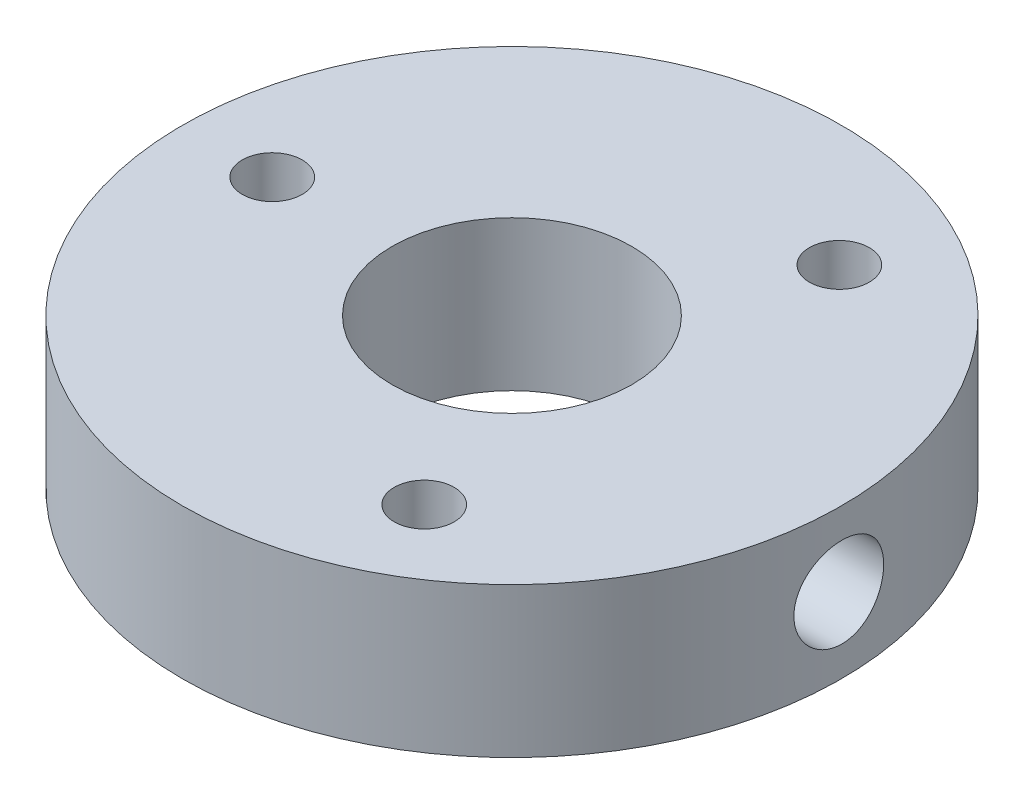
ISO-10303-21;
HEADER;
FILE_DESCRIPTION(('STEP AP214'),'2;1');
FILE_NAME('part.step','',(''),(''),'','','');
FILE_SCHEMA(('AUTOMOTIVE_DESIGN { 1 0 10303 214 1 1 1 1 }'));
ENDSEC;
DATA;
#1=APPLICATION_CONTEXT('core data for automotive mechanical design processes');
#2=APPLICATION_PROTOCOL_DEFINITION('international standard','automotive_design',2000,#1);
#3=PRODUCT_CONTEXT('',#1,'mechanical');
#4=PRODUCT('Part','Part','',(#3));
#5=PRODUCT_RELATED_PRODUCT_CATEGORY('part','',(#4));
#6=PRODUCT_DEFINITION_FORMATION('','',#4);
#7=PRODUCT_DEFINITION_CONTEXT('part definition',#1,'design');
#8=PRODUCT_DEFINITION('design','',#6,#7);
#9=PRODUCT_DEFINITION_SHAPE('','',#8);
#10=(LENGTH_UNIT() NAMED_UNIT(*) SI_UNIT(.MILLI.,.METRE.));
#11=(NAMED_UNIT(*) PLANE_ANGLE_UNIT() SI_UNIT($,.RADIAN.));
#12=(NAMED_UNIT(*) SI_UNIT($,.STERADIAN.) SOLID_ANGLE_UNIT());
#13=UNCERTAINTY_MEASURE_WITH_UNIT(LENGTH_MEASURE(1.E-05),#10,'distance_accuracy_value','');
#14=(GEOMETRIC_REPRESENTATION_CONTEXT(3) GLOBAL_UNCERTAINTY_ASSIGNED_CONTEXT((#13)) GLOBAL_UNIT_ASSIGNED_CONTEXT((#10,
#11,#12)) REPRESENTATION_CONTEXT('',''));
#15=CARTESIAN_POINT('',(0.,0.,0.));
#16=DIRECTION('',(0.,0.,1.));
#17=DIRECTION('',(1.,0.,0.));
#18=AXIS2_PLACEMENT_3D('',#15,#16,#17);
#19=CARTESIAN_POINT('',(0.,5.,0.));
#20=DIRECTION('',(0.,-1.,0.));
#21=DIRECTION('',(0.,0.,-1.));
#22=AXIS2_PLACEMENT_3D('',#19,#20,#21);
#23=CYLINDRICAL_SURFACE('',#22,11.);
#24=CARTESIAN_POINT('',(0.,5.,0.));
#25=DIRECTION('',(0.,1.,0.));
#26=DIRECTION('',(0.,0.,1.));
#27=AXIS2_PLACEMENT_3D('',#24,#25,#26);
#28=CIRCLE('',#27,11.);
#29=CARTESIAN_POINT('',(0.,5.,11.));
#30=VERTEX_POINT('',#29);
#31=EDGE_CURVE('E10',#30,#30,#28,.T.);
#32=ORIENTED_EDGE('',*,*,#31,.F.);
#33=EDGE_LOOP('',(#32));
#34=FACE_BOUND('',#33,.T.);
#35=CARTESIAN_POINT('',(0.,0.,0.));
#36=DIRECTION('',(0.,1.,0.));
#37=DIRECTION('',(0.,0.,1.));
#38=AXIS2_PLACEMENT_3D('',#35,#36,#37);
#39=CIRCLE('',#38,11.);
#40=CARTESIAN_POINT('',(0.,0.,11.));
#41=VERTEX_POINT('',#40);
#42=EDGE_CURVE('E42',#41,#41,#39,.T.);
#43=ORIENTED_EDGE('',*,*,#42,.T.);
#44=EDGE_LOOP('',(#43));
#45=FACE_BOUND('',#44,.T.);
#46=CARTESIAN_POINT('',(10.9999939067479,0.999973189554509,-0.0115780615405815));
#47=CARTESIAN_POINT('',(10.9999044002956,0.999976711132381,-0.0954239428171522));
#48=CARTESIAN_POINT('',(10.9988486008571,1.00702704512846,-0.179319631083675));
#49=CARTESIAN_POINT('',(10.9949080187248,1.03503735855822,-0.344769861813248));
#50=CARTESIAN_POINT('',(10.9920213790592,1.05601146150291,-0.426321939325376));
#51=CARTESIAN_POINT('',(10.98473686535,1.11123516899209,-0.584666224667857));
#52=CARTESIAN_POINT('',(10.9803400691835,1.14547530710418,-0.661461781454382));
#53=CARTESIAN_POINT('',(10.9705160795339,1.22623726751858,-0.808202920455653));
#54=CARTESIAN_POINT('',(10.9650890483315,1.2727571559883,-0.878149578868961));
#55=CARTESIAN_POINT('',(10.9537635745378,1.37708417850228,-1.00967984400745));
#56=CARTESIAN_POINT('',(10.9478625538162,1.43495591158858,-1.07121199577974));
#57=CARTESIAN_POINT('',(10.9362702751757,1.56020505433128,-1.18372266629456));
#58=CARTESIAN_POINT('',(10.9305790285062,1.62758297283648,-1.2347006197294));
#59=CARTESIAN_POINT('',(10.9200209026938,1.77026492357159,-1.32484675059802));
#60=CARTESIAN_POINT('',(10.9151573978268,1.84559946113343,-1.36396707348648));
#61=CARTESIAN_POINT('',(10.906837084338,2.0018476138882,-1.42898062192559));
#62=CARTESIAN_POINT('',(10.9033802111253,2.08276097270822,-1.45487445483607));
#63=CARTESIAN_POINT('',(10.8982882263128,2.24732559542325,-1.49254022772958));
#64=CARTESIAN_POINT('',(10.8966416950812,2.33095623040053,-1.50440072652711));
#65=CARTESIAN_POINT('',(10.8953209215694,2.49903579140636,-1.51393744719754));
#66=CARTESIAN_POINT('',(10.8956465841323,2.58348467775863,-1.51161435341767));
#67=CARTESIAN_POINT('',(10.8982232528905,2.75018819297928,-1.49292181211566));
#68=CARTESIAN_POINT('',(10.9004609427832,2.83245395009811,-1.47664951122397));
#69=CARTESIAN_POINT('',(10.9065902097652,2.99307607448458,-1.43067228746452));
#70=CARTESIAN_POINT('',(10.9104818264021,3.07143234822133,-1.4009670433966));
#71=CARTESIAN_POINT('',(10.919498027195,3.22231035776718,-1.32886437295365));
#72=CARTESIAN_POINT('',(10.9246266553675,3.29481189366574,-1.28642520365774));
#73=CARTESIAN_POINT('',(10.9355397462768,3.43170097824377,-1.19008946354791));
#74=CARTESIAN_POINT('',(10.9413242451384,3.49608807957349,-1.13619226149098));
#75=CARTESIAN_POINT('',(10.9529614111083,3.61548585862308,-1.01793301552608));
#76=CARTESIAN_POINT('',(10.958814243346,3.6704134739691,-0.953487091871597));
#77=CARTESIAN_POINT('',(10.9698893132462,3.76868518525505,-0.816247444682634));
#78=CARTESIAN_POINT('',(10.9751115484899,3.81202923676403,-0.743453689129999));
#79=CARTESIAN_POINT('',(10.9843481970648,3.88590922505678,-0.591509860023813));
#80=CARTESIAN_POINT('',(10.988361959237,3.91643826023238,-0.512356388672724));
#81=CARTESIAN_POINT('',(10.9947310344779,3.96374735450702,-0.349979063061778));
#82=CARTESIAN_POINT('',(10.9970864401793,3.98052818156342,-0.266755436430828));
#83=CARTESIAN_POINT('',(10.9998678371537,3.99975618390085,-0.0993087436609927));
#84=CARTESIAN_POINT('',(11.0003090228686,4.00231628431788,-0.0150988884889781));
#85=CARTESIAN_POINT('',(10.9992615884094,3.99332787428998,0.152550405083048));
#86=CARTESIAN_POINT('',(10.997773018736,3.98177973305065,0.235989863586379));
#87=CARTESIAN_POINT('',(10.993050105093,3.94499769004844,0.399382791138893));
#88=CARTESIAN_POINT('',(10.9898228878614,3.91981965537183,0.479349060854837));
#89=CARTESIAN_POINT('',(10.9819913273209,3.85654986445647,0.633925431514962));
#90=CARTESIAN_POINT('',(10.9773869302623,3.81845760418203,0.708535323264673));
#91=CARTESIAN_POINT('',(10.9672835328389,3.73017677096168,0.850771743827461));
#92=CARTESIAN_POINT('',(10.9617793511928,3.67991727682904,0.918353879614561));
#93=CARTESIAN_POINT('',(10.9505122316388,3.56882824318384,1.04416429686349));
#94=CARTESIAN_POINT('',(10.9447492814637,3.50799820217008,1.10239213427457));
#95=CARTESIAN_POINT('',(10.9335723115317,3.37699692939782,1.20824511832104));
#96=CARTESIAN_POINT('',(10.9281609394703,3.30676482123387,1.25579524784778));
#97=CARTESIAN_POINT('',(10.9183496786287,3.15924630749901,1.33842406066923));
#98=CARTESIAN_POINT('',(10.9139497671196,3.08196006049805,1.37350302421648));
#99=CARTESIAN_POINT('',(10.9066810546339,2.92275155286305,1.43007870532568));
#100=CARTESIAN_POINT('',(10.9038078069136,2.84084353370812,1.45161490316806));
#101=CARTESIAN_POINT('',(10.8999075128719,2.67453195419288,1.48061944438329));
#102=CARTESIAN_POINT('',(10.8988803644016,2.59012853217156,1.48808856612045));
#103=CARTESIAN_POINT('',(10.8987925921157,2.42195769079882,1.48873082572869));
#104=CARTESIAN_POINT('',(10.8997159948193,2.33819069982979,1.48202008538354));
#105=CARTESIAN_POINT('',(10.9033901730143,2.17298745367087,1.45474028049868));
#106=CARTESIAN_POINT('',(10.9061409476919,2.09155119744316,1.43417122212992));
#107=CARTESIAN_POINT('',(10.9131528707428,1.93334372943179,1.37979702053601));
#108=CARTESIAN_POINT('',(10.9174132542159,1.85657017814785,1.3459985795688));
#109=CARTESIAN_POINT('',(10.9269624876852,1.70976485000615,1.26613626694733));
#110=CARTESIAN_POINT('',(10.9322513595754,1.63973321671467,1.22007213417905));
#111=CARTESIAN_POINT('',(10.9433093878957,1.50780727073071,1.11655835227586));
#112=CARTESIAN_POINT('',(10.9490819836509,1.44598103541271,1.05902229948107));
#113=CARTESIAN_POINT('',(10.9604216604669,1.33281815760049,0.93437933205363));
#114=CARTESIAN_POINT('',(10.9659886932467,1.28148396671787,0.86727018674099));
#115=CARTESIAN_POINT('',(10.9763115058519,1.19056638907604,0.725043235411399));
#116=CARTESIAN_POINT('',(10.9810636131872,1.15103563158698,0.64989153192116));
#117=CARTESIAN_POINT('',(10.9891783998858,1.08521356199496,0.493990429589754));
#118=CARTESIAN_POINT('',(10.9925425585829,1.05890814719382,0.413247098335224));
#119=CARTESIAN_POINT('',(10.9967100519543,1.02644160832003,0.274827372205197));
#120=CARTESIAN_POINT('',(10.9979880488283,1.01653051392408,0.218015992941725));
#121=CARTESIAN_POINT('',(10.9996607217132,1.00329512551116,0.103618221672079));
#122=CARTESIAN_POINT('',(11.0000554059838,0.99997076990383,0.0460318369177843));
#123=CARTESIAN_POINT('',(10.9999939067479,0.999973189554509,-0.0115780615405815));
#124=B_SPLINE_CURVE_WITH_KNOTS('',3,(#46,#47,#48,#49,#50,#51,#52,#53,#54,#55,#56,#57,#58,#59,
#60,#61,#62,#63,#64,#65,#66,#67,#68,#69,#70,#71,#72,#73,#74,#75,#76,#77,#78,#79,#80,#81,#82,#83,
#84,#85,#86,#87,#88,#89,#90,#91,#92,#93,#94,#95,#96,#97,#98,#99,#100,#101,#102,#103,#104,#105,
#106,#107,#108,#109,#110,#111,#112,#113,#114,#115,#116,#117,#118,#119,#120,#121,#122,#123),
.UNSPECIFIED.,.T.,.F.,(4,2,2,2,2,2,2,2,2,2,2,2,2,2,2,2,2,2,2,2,2,2,2,2,2,2,2,2,2,2,2,2,2,2,2,2,
2,2,4),(0.,0.251327289981508,0.502909902968483,0.754313320259995,1.00567716977855,
1.25851525770487,1.51136688473197,1.76522577458424,2.01907300619958,2.27130961643428,
2.52353405654616,2.77401606645188,3.02450406604402,3.27582232859366,3.52715444029413,
3.78059190735547,4.03403034650999,4.28760510196434,4.54116569209054,4.79270987717716,
5.04424747961974,5.29476178499023,5.5452858689331,5.79730695556836,6.04934000217154,
6.30309187967885,6.55683805450331,6.80984102905535,7.06283000394816,7.31375523329677,
7.56468035091142,7.81547850926379,8.0662820070748,8.31905115917787,8.57187930694296,
8.82581848758399,9.07948630558812,9.25217308309859,9.42485824586635),.UNSPECIFIED.);
#125=CARTESIAN_POINT('',(10.9999939067479,0.999973189554509,-0.0115780615405815));
#126=VERTEX_POINT('',#125);
#127=EDGE_CURVE('E70',#126,#126,#124,.T.);
#128=ORIENTED_EDGE('',*,*,#127,.F.);
#129=EDGE_LOOP('',(#128));
#130=FACE_BOUND('',#129,.T.);
#131=ADVANCED_FACE('F30',(#34,#45,#130),#23,.T.);
#132=CARTESIAN_POINT('',(0.,5.,0.));
#133=DIRECTION('',(0.,-1.,0.));
#134=DIRECTION('',(0.,0.,-1.));
#135=AXIS2_PLACEMENT_3D('',#132,#133,#134);
#136=CYLINDRICAL_SURFACE('',#135,4.);
#137=CARTESIAN_POINT('',(0.,0.,0.));
#138=DIRECTION('',(0.,1.,0.));
#139=DIRECTION('',(0.,0.,1.));
#140=AXIS2_PLACEMENT_3D('',#137,#138,#139);
#141=CIRCLE('',#140,4.);
#142=CARTESIAN_POINT('',(0.,0.,4.));
#143=VERTEX_POINT('',#142);
#144=EDGE_CURVE('E49',#143,#143,#141,.T.);
#145=ORIENTED_EDGE('',*,*,#144,.F.);
#146=EDGE_LOOP('',(#145));
#147=FACE_BOUND('',#146,.T.);
#148=CARTESIAN_POINT('',(0.,5.,0.));
#149=DIRECTION('',(0.,1.,0.));
#150=DIRECTION('',(0.,0.,1.));
#151=AXIS2_PLACEMENT_3D('',#148,#149,#150);
#152=CIRCLE('',#151,4.);
#153=CARTESIAN_POINT('',(0.,5.,4.));
#154=VERTEX_POINT('',#153);
#155=EDGE_CURVE('E47',#154,#154,#152,.T.);
#156=ORIENTED_EDGE('',*,*,#155,.T.);
#157=EDGE_LOOP('',(#156));
#158=FACE_BOUND('',#157,.T.);
#159=CARTESIAN_POINT('',(3.99998324352627,0.999973189554461,-0.0115780615405819));
#160=CARTESIAN_POINT('',(3.99975008554708,0.999970344589806,-0.0928628499127886));
#161=CARTESIAN_POINT('',(3.99701341518181,1.00660111653291,-0.174120798016054));
#162=CARTESIAN_POINT('',(3.98682130674948,1.03283486326652,-0.334193212942549));
#163=CARTESIAN_POINT('',(3.97936650598513,1.05243608608623,-0.413008008267291));
#164=CARTESIAN_POINT('',(3.96052082036351,1.10381405386754,-0.565863400872514));
#165=CARTESIAN_POINT('',(3.94913764614027,1.13556696063538,-0.639913015944727));
#166=CARTESIAN_POINT('',(3.92355146951754,1.21022564505436,-0.781623509330774));
#167=CARTESIAN_POINT('',(3.90934771247029,1.25313440841045,-0.849282670712558));
#168=CARTESIAN_POINT('',(3.87889078281248,1.35081392052441,-0.979199713670536));
#169=CARTESIAN_POINT('',(3.86257952514767,1.40597987330045,-1.04114672329833));
#170=CARTESIAN_POINT('',(3.83003121413836,1.52576936090546,-1.15515471741959));
#171=CARTESIAN_POINT('',(3.81379418521259,1.59039580527675,-1.2072126492027));
#172=CARTESIAN_POINT('',(3.78254273246675,1.73026294512599,-1.30190458734573));
#173=CARTESIAN_POINT('',(3.76759791738499,1.80581297173165,-1.3441069284853));
#174=CARTESIAN_POINT('',(3.74152823394741,1.96359581643656,-1.41506404169484));
#175=CARTESIAN_POINT('',(3.73040179592602,2.04582587126365,-1.44382434130825));
#176=CARTESIAN_POINT('',(3.71386253492558,2.211000319316,-1.48583929908874));
#177=CARTESIAN_POINT('',(3.7082287534549,2.29376867612318,-1.49969614198542));
#178=CARTESIAN_POINT('',(3.70266090021209,2.46063289403003,-1.51339438709441));
#179=CARTESIAN_POINT('',(3.70272444475709,2.54472818523452,-1.51324165072145));
#180=CARTESIAN_POINT('',(3.70835486903642,2.70642618018637,-1.4993825756083));
#181=CARTESIAN_POINT('',(3.71358756798555,2.78411320704535,-1.48649924275674));
#182=CARTESIAN_POINT('',(3.72841590316254,2.93612790331047,-1.44890266336808));
#183=CARTESIAN_POINT('',(3.73801220421891,3.0104550589164,-1.42418761414722));
#184=CARTESIAN_POINT('',(3.7606954708555,3.15532654656717,-1.3631737441909));
#185=CARTESIAN_POINT('',(3.77384625274862,3.22577013919292,-1.32666049118578));
#186=CARTESIAN_POINT('',(3.80214335816573,3.35976767038173,-1.24323861437436));
#187=CARTESIAN_POINT('',(3.81729037578849,3.42331919847259,-1.19632637091242));
#188=CARTESIAN_POINT('',(3.84914555944359,3.54629447522197,-1.08966853799965));
#189=CARTESIAN_POINT('',(3.86588969675817,3.60513993697385,-1.02926532229988));
#190=CARTESIAN_POINT('',(3.89818043796217,3.71203825019438,-0.899261302268098));
#191=CARTESIAN_POINT('',(3.91372684917553,3.76008936756814,-0.829659022969195));
#192=CARTESIAN_POINT('',(3.94221113310178,3.8447026635441,-0.681711093905407));
#193=CARTESIAN_POINT('',(3.95510235757426,3.8810648118745,-0.603241422872247));
#194=CARTESIAN_POINT('',(3.97649279579293,3.93987649720795,-0.440692644837723));
#195=CARTESIAN_POINT('',(3.98499396386388,3.96233222583093,-0.356616052728382));
#196=CARTESIAN_POINT('',(3.99630791917595,3.9915879889453,-0.190047286850731));
#197=CARTESIAN_POINT('',(3.99939954802317,3.99915812800678,-0.107709210295274));
#198=CARTESIAN_POINT('',(4.00044046134103,4.00066276920371,0.0571144776457788));
#199=CARTESIAN_POINT('',(3.99839091439389,3.99460037002883,0.13960005124675));
#200=CARTESIAN_POINT('',(3.98957835374415,3.96960065090721,0.298984506989955));
#201=CARTESIAN_POINT('',(3.9830033920028,3.95117771238025,0.375975612427952));
#202=CARTESIAN_POINT('',(3.96601746346786,3.90264961804183,0.525726911204085));
#203=CARTESIAN_POINT('',(3.9556060098418,3.87254297959897,0.598486566234137));
#204=CARTESIAN_POINT('',(3.93162049822347,3.80056935441741,0.740043350915932));
#205=CARTESIAN_POINT('',(3.91796453813558,3.75839077379971,0.808667739861773));
#206=CARTESIAN_POINT('',(3.88900736327882,3.66382260696433,0.938097766999711));
#207=CARTESIAN_POINT('',(3.87370554817124,3.61142928913878,0.998900534313277));
#208=CARTESIAN_POINT('',(3.84205718511951,3.49436262149545,1.11463136577909));
#209=CARTESIAN_POINT('',(3.82570130693831,3.4291550887557,1.16901791033276));
#210=CARTESIAN_POINT('',(3.79465134791515,3.29022682093134,1.26618750552289));
#211=CARTESIAN_POINT('',(3.77995741951836,3.21650530613879,1.30896949221407));
#212=CARTESIAN_POINT('',(3.7539555435991,3.06199239818725,1.38178422652516));
#213=CARTESIAN_POINT('',(3.74266381223775,2.98116944589477,1.41175619177559));
#214=CARTESIAN_POINT('',(3.72510206372358,2.81508753633808,1.45747241666091));
#215=CARTESIAN_POINT('',(3.71882900164919,2.7298313023242,1.47322530402451));
#216=CARTESIAN_POINT('',(3.71242566949362,2.56309653328512,1.48928285927295));
#217=CARTESIAN_POINT('',(3.71193279140504,2.48171904954597,1.4904995243622));
#218=CARTESIAN_POINT('',(3.71621621167578,2.31998312988443,1.47978705914164));
#219=CARTESIAN_POINT('',(3.72099201372942,2.23962459869867,1.4678591670393));
#220=CARTESIAN_POINT('',(3.73496817769586,2.08466204182012,1.43190952995105));
#221=CARTESIAN_POINT('',(3.74403107088274,2.00995761843741,1.40826251490059));
#222=CARTESIAN_POINT('',(3.76547451953202,1.86553225315161,1.3498755867597));
#223=CARTESIAN_POINT('',(3.77785590919751,1.79581256990172,1.31513288401585));
#224=CARTESIAN_POINT('',(3.80532973589449,1.65941718971878,1.23345488280831));
#225=CARTESIAN_POINT('',(3.82052923055354,1.59308515236512,1.1859821472397));
#226=CARTESIAN_POINT('',(3.85154330915767,1.46903490625169,1.08102092809232));
#227=CARTESIAN_POINT('',(3.86735808455619,1.41131940611585,1.02352930731625));
#228=CARTESIAN_POINT('',(3.89881370113743,1.30302555568319,0.896519203923319));
#229=CARTESIAN_POINT('',(3.91440097218005,1.2529870807425,0.826525022862916));
#230=CARTESIAN_POINT('',(3.94274145165301,1.16540036963614,0.678570632203612));
#231=CARTESIAN_POINT('',(3.95549447280402,1.12785295876371,0.600609896693603));
#232=CARTESIAN_POINT('',(3.97713028949401,1.06531271503254,0.43547635407405));
#233=CARTESIAN_POINT('',(3.98583043074156,1.0409058049533,0.348055471598271));
#234=CARTESIAN_POINT('',(3.99738558152512,1.00824157970778,0.169884795507907));
#235=CARTESIAN_POINT('',(4.00024345038447,0.999976364566172,0.0791366524686268));
#236=CARTESIAN_POINT('',(3.99998324352627,0.999973189554461,-0.0115780615405819));
#237=B_SPLINE_CURVE_WITH_KNOTS('',3,(#159,#160,#161,#162,#163,#164,#165,#166,#167,#168,#169,
#170,#171,#172,#173,#174,#175,#176,#177,#178,#179,#180,#181,#182,#183,#184,#185,#186,#187,#188,
#189,#190,#191,#192,#193,#194,#195,#196,#197,#198,#199,#200,#201,#202,#203,#204,#205,#206,#207,
#208,#209,#210,#211,#212,#213,#214,#215,#216,#217,#218,#219,#220,#221,#222,#223,#224,#225,#226,
#227,#228,#229,#230,#231,#232,#233,#234,#235,#236),.UNSPECIFIED.,.T.,.F.,(4,2,2,2,2,2,2,2,2,2,2,
2,2,2,2,2,2,2,2,2,2,2,2,2,2,2,2,2,2,2,2,2,2,2,2,2,2,2,4),(0.,0.243520270862958,0.48700765517942,
0.730019813968818,0.973097078547077,1.22559308238225,1.47816690429599,1.74030802023697,
2.00234124527216,2.25333541568379,2.50422457407539,2.73988957661848,2.97559049658331,
3.21584203169859,3.45617732467408,3.71292561707163,3.96971512623944,4.23069018380367,
4.49154896253245,4.73851477952211,4.98542446660697,5.22264847314821,5.45990259265287,
5.70393920074594,5.94806512695419,6.20627937596034,6.46451729093012,6.72396727253411,
6.98325972129639,7.22619204152593,7.4691014796684,7.70470127432034,7.94036034964815,
8.18820144633553,8.43612028900862,8.69716916958611,8.95823529441979,9.23013969086617,
9.5019109800479),.UNSPECIFIED.);
#238=CARTESIAN_POINT('',(3.99998324352627,0.999973189554461,-0.0115780615405819));
#239=VERTEX_POINT('',#238);
#240=EDGE_CURVE('E34',#239,#239,#237,.T.);
#241=ORIENTED_EDGE('',*,*,#240,.T.);
#242=EDGE_LOOP('',(#241));
#243=FACE_BOUND('',#242,.T.);
#244=ADVANCED_FACE('F94',(#147,#158,#243),#136,.F.);
#245=CARTESIAN_POINT('',(0.,5.,0.));
#246=DIRECTION('',(0.,1.,0.));
#247=DIRECTION('',(0.,0.,1.));
#248=AXIS2_PLACEMENT_3D('',#245,#246,#247);
#249=PLANE('',#248);
#250=CARTESIAN_POINT('',(4.00000000000002,5.,-6.92820323027549));
#251=DIRECTION('',(0.,1.,0.));
#252=DIRECTION('',(0.,0.,1.));
#253=AXIS2_PLACEMENT_3D('',#250,#251,#252);
#254=CIRCLE('',#253,0.999999999999999);
#255=CARTESIAN_POINT('',(4.00000000000002,5.,-5.92820323027549));
#256=VERTEX_POINT('',#255);
#257=EDGE_CURVE('E58',#256,#256,#254,.T.);
#258=ORIENTED_EDGE('',*,*,#257,.F.);
#259=EDGE_LOOP('',(#258));
#260=FACE_BOUND('',#259,.T.);
#261=ORIENTED_EDGE('',*,*,#155,.F.);
#262=EDGE_LOOP('',(#261));
#263=FACE_BOUND('',#262,.T.);
#264=ORIENTED_EDGE('',*,*,#31,.T.);
#265=EDGE_LOOP('',(#264));
#266=FACE_BOUND('',#265,.T.);
#267=CARTESIAN_POINT('',(-8.,5.,0.));
#268=DIRECTION('',(0.,1.,0.));
#269=DIRECTION('',(0.,0.,1.));
#270=AXIS2_PLACEMENT_3D('',#267,#268,#269);
#271=CIRCLE('',#270,1.);
#272=CARTESIAN_POINT('',(-8.,5.,1.));
#273=VERTEX_POINT('',#272);
#274=EDGE_CURVE('E52',#273,#273,#271,.T.);
#275=ORIENTED_EDGE('',*,*,#274,.F.);
#276=EDGE_LOOP('',(#275));
#277=FACE_BOUND('',#276,.T.);
#278=CARTESIAN_POINT('',(3.99999999999993,5.,6.92820323027555));
#279=DIRECTION('',(0.,1.,0.));
#280=DIRECTION('',(0.,0.,1.));
#281=AXIS2_PLACEMENT_3D('',#278,#279,#280);
#282=CIRCLE('',#281,0.999999999999998);
#283=CARTESIAN_POINT('',(3.99999999999993,5.,7.92820323027555));
#284=VERTEX_POINT('',#283);
#285=EDGE_CURVE('E64',#284,#284,#282,.T.);
#286=ORIENTED_EDGE('',*,*,#285,.F.);
#287=EDGE_LOOP('',(#286));
#288=FACE_BOUND('',#287,.T.);
#289=ADVANCED_FACE('F98',(#260,#263,#266,#277,#288),#249,.T.);
#290=CARTESIAN_POINT('',(0.,0.,0.));
#291=DIRECTION('',(0.,1.,0.));
#292=DIRECTION('',(0.,0.,1.));
#293=AXIS2_PLACEMENT_3D('',#290,#291,#292);
#294=PLANE('',#293);
#295=ORIENTED_EDGE('',*,*,#42,.F.);
#296=EDGE_LOOP('',(#295));
#297=FACE_BOUND('',#296,.T.);
#298=ORIENTED_EDGE('',*,*,#144,.T.);
#299=EDGE_LOOP('',(#298));
#300=FACE_BOUND('',#299,.T.);
#301=CARTESIAN_POINT('',(-8.,0.,0.));
#302=DIRECTION('',(0.,1.,0.));
#303=DIRECTION('',(0.,0.,1.));
#304=AXIS2_PLACEMENT_3D('',#301,#302,#303);
#305=CIRCLE('',#304,1.);
#306=CARTESIAN_POINT('',(-8.,0.,1.));
#307=VERTEX_POINT('',#306);
#308=EDGE_CURVE('E55',#307,#307,#305,.T.);
#309=ORIENTED_EDGE('',*,*,#308,.T.);
#310=EDGE_LOOP('',(#309));
#311=FACE_BOUND('',#310,.T.);
#312=CARTESIAN_POINT('',(4.00000000000002,0.,-6.92820323027549));
#313=DIRECTION('',(0.,1.,0.));
#314=DIRECTION('',(0.,0.,1.));
#315=AXIS2_PLACEMENT_3D('',#312,#313,#314);
#316=CIRCLE('',#315,0.999999999999999);
#317=CARTESIAN_POINT('',(4.00000000000002,0.,-5.92820323027549));
#318=VERTEX_POINT('',#317);
#319=EDGE_CURVE('E61',#318,#318,#316,.T.);
#320=ORIENTED_EDGE('',*,*,#319,.T.);
#321=EDGE_LOOP('',(#320));
#322=FACE_BOUND('',#321,.T.);
#323=CARTESIAN_POINT('',(3.99999999999993,0.,6.92820323027555));
#324=DIRECTION('',(0.,1.,0.));
#325=DIRECTION('',(0.,0.,1.));
#326=AXIS2_PLACEMENT_3D('',#323,#324,#325);
#327=CIRCLE('',#326,0.999999999999998);
#328=CARTESIAN_POINT('',(3.99999999999993,0.,7.92820323027555));
#329=VERTEX_POINT('',#328);
#330=EDGE_CURVE('E67',#329,#329,#327,.T.);
#331=ORIENTED_EDGE('',*,*,#330,.T.);
#332=EDGE_LOOP('',(#331));
#333=FACE_BOUND('',#332,.T.);
#334=ADVANCED_FACE('F92',(#297,#300,#311,#322,#333),#294,.F.);
#335=CARTESIAN_POINT('',(-8.,5.,0.));
#336=DIRECTION('',(0.,-1.,0.));
#337=DIRECTION('',(0.,0.,-1.));
#338=AXIS2_PLACEMENT_3D('',#335,#336,#337);
#339=CYLINDRICAL_SURFACE('',#338,1.);
#340=ORIENTED_EDGE('',*,*,#274,.T.);
#341=EDGE_LOOP('',(#340));
#342=FACE_BOUND('',#341,.T.);
#343=ORIENTED_EDGE('',*,*,#308,.F.);
#344=EDGE_LOOP('',(#343));
#345=FACE_BOUND('',#344,.T.);
#346=ADVANCED_FACE('F89',(#342,#345),#339,.F.);
#347=CARTESIAN_POINT('',(4.00000000000002,5.,-6.92820323027549));
#348=DIRECTION('',(0.,-1.,0.));
#349=DIRECTION('',(0.,0.,-1.));
#350=AXIS2_PLACEMENT_3D('',#347,#348,#349);
#351=CYLINDRICAL_SURFACE('',#350,0.999999999999999);
#352=ORIENTED_EDGE('',*,*,#257,.T.);
#353=EDGE_LOOP('',(#352));
#354=FACE_BOUND('',#353,.T.);
#355=ORIENTED_EDGE('',*,*,#319,.F.);
#356=EDGE_LOOP('',(#355));
#357=FACE_BOUND('',#356,.T.);
#358=ADVANCED_FACE('F85',(#354,#357),#351,.F.);
#359=CARTESIAN_POINT('',(3.99999999999993,5.,6.92820323027555));
#360=DIRECTION('',(0.,-1.,0.));
#361=DIRECTION('',(0.,0.,-1.));
#362=AXIS2_PLACEMENT_3D('',#359,#360,#361);
#363=CYLINDRICAL_SURFACE('',#362,0.999999999999998);
#364=ORIENTED_EDGE('',*,*,#285,.T.);
#365=EDGE_LOOP('',(#364));
#366=FACE_BOUND('',#365,.T.);
#367=ORIENTED_EDGE('',*,*,#330,.F.);
#368=EDGE_LOOP('',(#367));
#369=FACE_BOUND('',#368,.T.);
#370=ADVANCED_FACE('F80',(#366,#369),#363,.F.);
#371=CARTESIAN_POINT('',(20.9986746062882,2.49997318955458,-0.0115780615405809));
#372=DIRECTION('',(-1.,0.,0.));
#373=DIRECTION('',(0.,-1.,0.));
#374=AXIS2_PLACEMENT_3D('',#371,#372,#373);
#375=CYLINDRICAL_SURFACE('',#374,1.5);
#376=ORIENTED_EDGE('',*,*,#240,.F.);
#377=EDGE_LOOP('',(#376));
#378=FACE_BOUND('',#377,.T.);
#379=ORIENTED_EDGE('',*,*,#127,.T.);
#380=EDGE_LOOP('',(#379));
#381=FACE_BOUND('',#380,.T.);
#382=ADVANCED_FACE('F76',(#378,#381),#375,.F.);
#383=CLOSED_SHELL('',(#131,#244,#289,#334,#346,#358,#370,#382));
#384=MANIFOLD_SOLID_BREP('B2',#383);
#385=ADVANCED_BREP_SHAPE_REPRESENTATION('',(#18,#384),#14);
#386=SHAPE_DEFINITION_REPRESENTATION(#9,#385);
ENDSEC;
END-ISO-10303-21;
